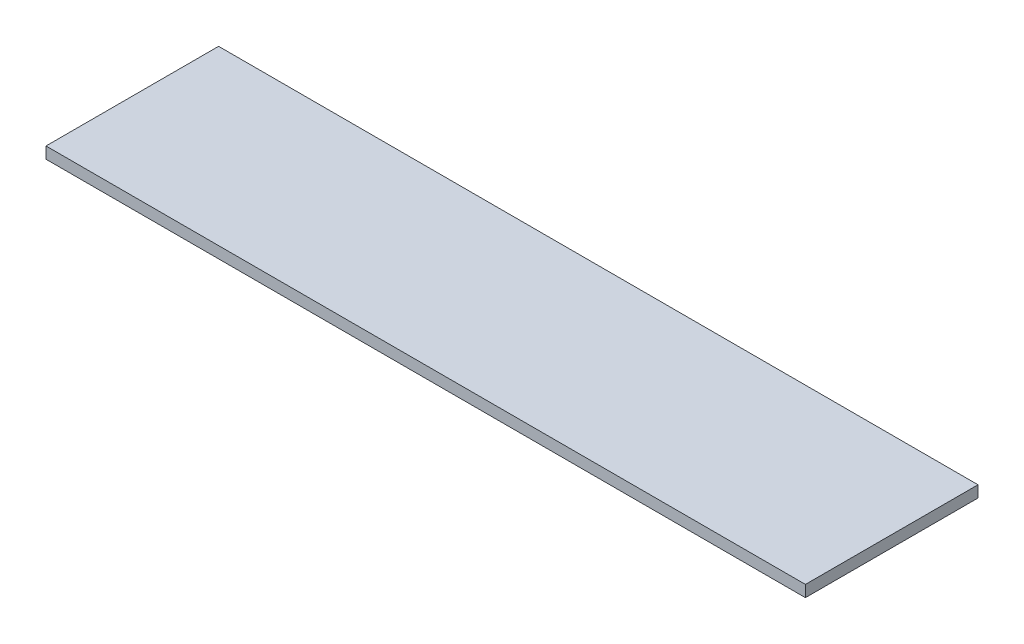
ISO-10303-21;
HEADER;
FILE_DESCRIPTION(('STEP AP214'),'2;1');
FILE_NAME('part.step','',(''),(''),'','','');
FILE_SCHEMA(('AUTOMOTIVE_DESIGN { 1 0 10303 214 1 1 1 1 }'));
ENDSEC;
DATA;
#1=APPLICATION_CONTEXT('core data for automotive mechanical design processes');
#2=APPLICATION_PROTOCOL_DEFINITION('international standard','automotive_design',2000,#1);
#3=PRODUCT_CONTEXT('',#1,'mechanical');
#4=PRODUCT('Part','Part','',(#3));
#5=PRODUCT_RELATED_PRODUCT_CATEGORY('part','',(#4));
#6=PRODUCT_DEFINITION_FORMATION('','',#4);
#7=PRODUCT_DEFINITION_CONTEXT('part definition',#1,'design');
#8=PRODUCT_DEFINITION('design','',#6,#7);
#9=PRODUCT_DEFINITION_SHAPE('','',#8);
#10=(LENGTH_UNIT() NAMED_UNIT(*) SI_UNIT(.MILLI.,.METRE.));
#11=(NAMED_UNIT(*) PLANE_ANGLE_UNIT() SI_UNIT($,.RADIAN.));
#12=(NAMED_UNIT(*) SI_UNIT($,.STERADIAN.) SOLID_ANGLE_UNIT());
#13=UNCERTAINTY_MEASURE_WITH_UNIT(LENGTH_MEASURE(1.E-05),#10,'distance_accuracy_value','');
#14=(GEOMETRIC_REPRESENTATION_CONTEXT(3) GLOBAL_UNCERTAINTY_ASSIGNED_CONTEXT((#13)) GLOBAL_UNIT_ASSIGNED_CONTEXT((#10,
#11,#12)) REPRESENTATION_CONTEXT('',''));
#15=CARTESIAN_POINT('',(0.,0.,0.));
#16=DIRECTION('',(0.,0.,1.));
#17=DIRECTION('',(1.,0.,0.));
#18=AXIS2_PLACEMENT_3D('',#15,#16,#17);
#19=CARTESIAN_POINT('',(52.3875,1.5875,-11.90625));
#20=DIRECTION('',(-1.,0.,0.));
#21=DIRECTION('',(0.,0.,1.));
#22=AXIS2_PLACEMENT_3D('',#19,#20,#21);
#23=PLANE('',#22);
#24=DIRECTION('',(0.,0.,-1.));
#25=VECTOR('',#24,1.);
#26=CARTESIAN_POINT('',(52.3875,0.,-11.90625));
#27=LINE('',#26,#25);
#28=CARTESIAN_POINT('',(52.3875,0.,11.90625));
#29=VERTEX_POINT('',#28);
#30=CARTESIAN_POINT('',(52.3875,0.,-11.90625));
#31=VERTEX_POINT('',#30);
#32=EDGE_CURVE('E107',#29,#31,#27,.T.);
#33=ORIENTED_EDGE('',*,*,#32,.T.);
#34=DIRECTION('',(0.,-1.,0.));
#35=VECTOR('',#34,1.);
#36=CARTESIAN_POINT('',(52.3875,1.5875,-11.90625));
#37=LINE('',#36,#35);
#38=CARTESIAN_POINT('',(52.3875,1.5875,-11.90625));
#39=VERTEX_POINT('',#38);
#40=EDGE_CURVE('E11',#39,#31,#37,.T.);
#41=ORIENTED_EDGE('',*,*,#40,.F.);
#42=DIRECTION('',(0.,0.,-1.));
#43=VECTOR('',#42,1.);
#44=CARTESIAN_POINT('',(52.3875,1.5875,-11.90625));
#45=LINE('',#44,#43);
#46=CARTESIAN_POINT('',(52.3875,1.5875,11.90625));
#47=VERTEX_POINT('',#46);
#48=EDGE_CURVE('E91',#47,#39,#45,.T.);
#49=ORIENTED_EDGE('',*,*,#48,.F.);
#50=DIRECTION('',(0.,-1.,0.));
#51=VECTOR('',#50,1.);
#52=CARTESIAN_POINT('',(52.3875,1.5875,11.90625));
#53=LINE('',#52,#51);
#54=EDGE_CURVE('E103',#47,#29,#53,.T.);
#55=ORIENTED_EDGE('',*,*,#54,.T.);
#56=EDGE_LOOP('',(#33,#41,#49,#55));
#57=FACE_BOUND('',#56,.T.);
#58=ADVANCED_FACE('F39',(#57),#23,.F.);
#59=CARTESIAN_POINT('',(-52.3875,1.5875,-11.90625));
#60=DIRECTION('',(0.,0.,1.));
#61=DIRECTION('',(1.,0.,0.));
#62=AXIS2_PLACEMENT_3D('',#59,#60,#61);
#63=PLANE('',#62);
#64=DIRECTION('',(-1.,0.,0.));
#65=VECTOR('',#64,1.);
#66=CARTESIAN_POINT('',(-52.3875,0.,-11.90625));
#67=LINE('',#66,#65);
#68=CARTESIAN_POINT('',(-52.3875,0.,-11.90625));
#69=VERTEX_POINT('',#68);
#70=EDGE_CURVE('E96',#31,#69,#67,.T.);
#71=ORIENTED_EDGE('',*,*,#70,.T.);
#72=DIRECTION('',(0.,-1.,0.));
#73=VECTOR('',#72,1.);
#74=CARTESIAN_POINT('',(-52.3875,1.5875,-11.90625));
#75=LINE('',#74,#73);
#76=CARTESIAN_POINT('',(-52.3875,1.5875,-11.90625));
#77=VERTEX_POINT('',#76);
#78=EDGE_CURVE('E48',#77,#69,#75,.T.);
#79=ORIENTED_EDGE('',*,*,#78,.F.);
#80=DIRECTION('',(-1.,0.,0.));
#81=VECTOR('',#80,1.);
#82=CARTESIAN_POINT('',(-52.3875,1.5875,-11.90625));
#83=LINE('',#82,#81);
#84=EDGE_CURVE('E86',#39,#77,#83,.T.);
#85=ORIENTED_EDGE('',*,*,#84,.F.);
#86=ORIENTED_EDGE('',*,*,#40,.T.);
#87=EDGE_LOOP('',(#71,#79,#85,#86));
#88=FACE_BOUND('',#87,.T.);
#89=ADVANCED_FACE('F95',(#88),#63,.F.);
#90=CARTESIAN_POINT('',(-52.3875,1.5875,-11.90625));
#91=DIRECTION('',(1.,0.,0.));
#92=DIRECTION('',(0.,0.,-1.));
#93=AXIS2_PLACEMENT_3D('',#90,#91,#92);
#94=PLANE('',#93);
#95=DIRECTION('',(0.,0.,1.));
#96=VECTOR('',#95,1.);
#97=CARTESIAN_POINT('',(-52.3875,0.,-11.90625));
#98=LINE('',#97,#96);
#99=CARTESIAN_POINT('',(-52.3875,0.,11.90625));
#100=VERTEX_POINT('',#99);
#101=EDGE_CURVE('E73',#69,#100,#98,.T.);
#102=ORIENTED_EDGE('',*,*,#101,.T.);
#103=DIRECTION('',(0.,-1.,0.));
#104=VECTOR('',#103,1.);
#105=CARTESIAN_POINT('',(-52.3875,1.5875,11.90625));
#106=LINE('',#105,#104);
#107=CARTESIAN_POINT('',(-52.3875,1.5875,11.90625));
#108=VERTEX_POINT('',#107);
#109=EDGE_CURVE('E98',#108,#100,#106,.T.);
#110=ORIENTED_EDGE('',*,*,#109,.F.);
#111=DIRECTION('',(0.,0.,1.));
#112=VECTOR('',#111,1.);
#113=CARTESIAN_POINT('',(-52.3875,1.5875,-11.90625));
#114=LINE('',#113,#112);
#115=EDGE_CURVE('E89',#77,#108,#114,.T.);
#116=ORIENTED_EDGE('',*,*,#115,.F.);
#117=ORIENTED_EDGE('',*,*,#78,.T.);
#118=EDGE_LOOP('',(#102,#110,#116,#117));
#119=FACE_BOUND('',#118,.T.);
#120=ADVANCED_FACE('F99',(#119),#94,.F.);
#121=CARTESIAN_POINT('',(-52.3875,1.5875,11.90625));
#122=DIRECTION('',(0.,0.,-1.));
#123=DIRECTION('',(-1.,0.,0.));
#124=AXIS2_PLACEMENT_3D('',#121,#122,#123);
#125=PLANE('',#124);
#126=DIRECTION('',(1.,0.,0.));
#127=VECTOR('',#126,1.);
#128=CARTESIAN_POINT('',(-52.3875,0.,11.90625));
#129=LINE('',#128,#127);
#130=EDGE_CURVE('E79',#100,#29,#129,.T.);
#131=ORIENTED_EDGE('',*,*,#130,.T.);
#132=ORIENTED_EDGE('',*,*,#54,.F.);
#133=DIRECTION('',(1.,0.,0.));
#134=VECTOR('',#133,1.);
#135=CARTESIAN_POINT('',(-52.3875,1.5875,11.90625));
#136=LINE('',#135,#134);
#137=EDGE_CURVE('E56',#108,#47,#136,.T.);
#138=ORIENTED_EDGE('',*,*,#137,.F.);
#139=ORIENTED_EDGE('',*,*,#109,.T.);
#140=EDGE_LOOP('',(#131,#132,#138,#139));
#141=FACE_BOUND('',#140,.T.);
#142=ADVANCED_FACE('F120',(#141),#125,.F.);
#143=CARTESIAN_POINT('',(0.,1.5875,0.));
#144=DIRECTION('',(0.,1.,0.));
#145=DIRECTION('',(0.,0.,1.));
#146=AXIS2_PLACEMENT_3D('',#143,#144,#145);
#147=PLANE('',#146);
#148=ORIENTED_EDGE('',*,*,#48,.T.);
#149=ORIENTED_EDGE('',*,*,#84,.T.);
#150=ORIENTED_EDGE('',*,*,#115,.T.);
#151=ORIENTED_EDGE('',*,*,#137,.T.);
#152=EDGE_LOOP('',(#148,#149,#150,#151));
#153=FACE_BOUND('',#152,.T.);
#154=ADVANCED_FACE('F87',(#153),#147,.T.);
#155=CARTESIAN_POINT('',(0.,0.,0.));
#156=DIRECTION('',(0.,1.,0.));
#157=DIRECTION('',(0.,0.,1.));
#158=AXIS2_PLACEMENT_3D('',#155,#156,#157);
#159=PLANE('',#158);
#160=ORIENTED_EDGE('',*,*,#32,.F.);
#161=ORIENTED_EDGE('',*,*,#130,.F.);
#162=ORIENTED_EDGE('',*,*,#101,.F.);
#163=ORIENTED_EDGE('',*,*,#70,.F.);
#164=EDGE_LOOP('',(#160,#161,#162,#163));
#165=FACE_BOUND('',#164,.T.);
#166=ADVANCED_FACE('F123',(#165),#159,.F.);
#167=CLOSED_SHELL('',(#58,#89,#120,#142,#154,#166));
#168=MANIFOLD_SOLID_BREP('B2',#167);
#169=ADVANCED_BREP_SHAPE_REPRESENTATION('',(#18,#168),#14);
#170=SHAPE_DEFINITION_REPRESENTATION(#9,#169);
ENDSEC;
END-ISO-10303-21;
